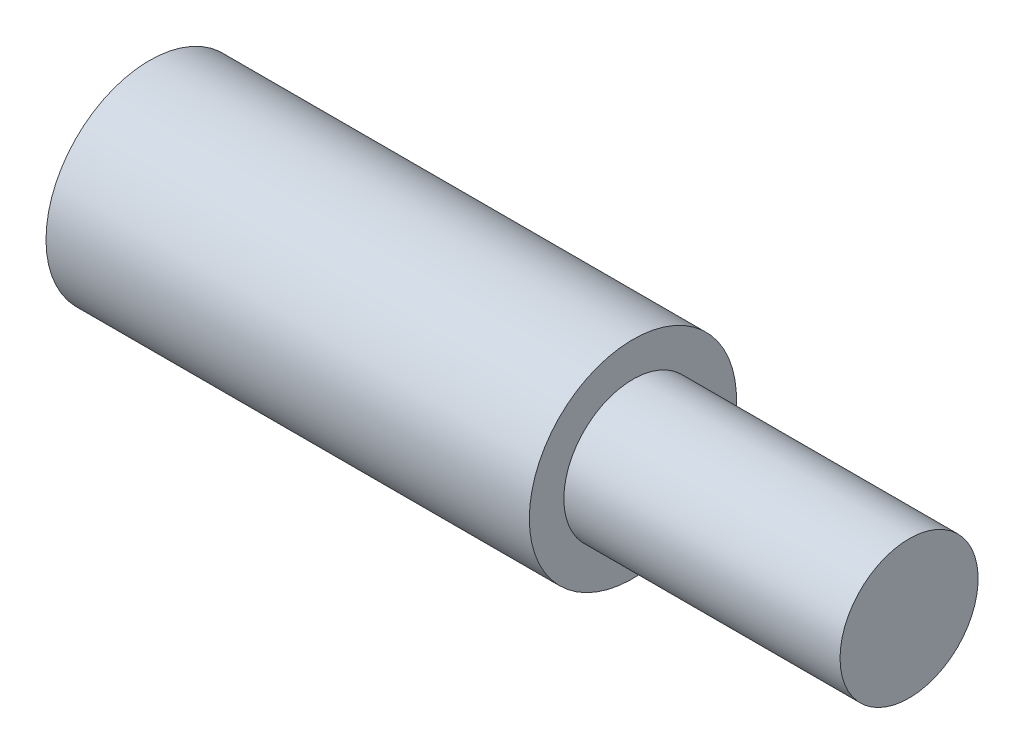
ISO-10303-21;
HEADER;
FILE_DESCRIPTION(('STEP AP214'),'2;1');
FILE_NAME('part.step','',(''),(''),'','','');
FILE_SCHEMA(('AUTOMOTIVE_DESIGN { 1 0 10303 214 1 1 1 1 }'));
ENDSEC;
DATA;
#1=APPLICATION_CONTEXT('core data for automotive mechanical design processes');
#2=APPLICATION_PROTOCOL_DEFINITION('international standard','automotive_design',2000,#1);
#3=PRODUCT_CONTEXT('',#1,'mechanical');
#4=PRODUCT('Part','Part','',(#3));
#5=PRODUCT_RELATED_PRODUCT_CATEGORY('part','',(#4));
#6=PRODUCT_DEFINITION_FORMATION('','',#4);
#7=PRODUCT_DEFINITION_CONTEXT('part definition',#1,'design');
#8=PRODUCT_DEFINITION('design','',#6,#7);
#9=PRODUCT_DEFINITION_SHAPE('','',#8);
#10=(LENGTH_UNIT() NAMED_UNIT(*) SI_UNIT(.MILLI.,.METRE.));
#11=(NAMED_UNIT(*) PLANE_ANGLE_UNIT() SI_UNIT($,.RADIAN.));
#12=(NAMED_UNIT(*) SI_UNIT($,.STERADIAN.) SOLID_ANGLE_UNIT());
#13=UNCERTAINTY_MEASURE_WITH_UNIT(LENGTH_MEASURE(1.E-05),#10,'distance_accuracy_value','');
#14=(GEOMETRIC_REPRESENTATION_CONTEXT(3) GLOBAL_UNCERTAINTY_ASSIGNED_CONTEXT((#13)) GLOBAL_UNIT_ASSIGNED_CONTEXT((#10,
#11,#12)) REPRESENTATION_CONTEXT('',''));
#15=CARTESIAN_POINT('',(0.,0.,0.));
#16=DIRECTION('',(0.,0.,1.));
#17=DIRECTION('',(1.,0.,0.));
#18=AXIS2_PLACEMENT_3D('',#15,#16,#17);
#19=CARTESIAN_POINT('',(0.,0.,0.));
#20=DIRECTION('',(1.,0.,0.));
#21=DIRECTION('',(0.,0.,-1.));
#22=AXIS2_PLACEMENT_3D('',#19,#20,#21);
#23=PLANE('',#22);
#24=CARTESIAN_POINT('',(0.,0.,0.));
#25=DIRECTION('',(-1.,0.,0.));
#26=DIRECTION('',(0.,0.,1.));
#27=AXIS2_PLACEMENT_3D('',#24,#25,#26);
#28=CIRCLE('',#27,1.5);
#29=CARTESIAN_POINT('',(0.,0.,1.5));
#30=VERTEX_POINT('',#29);
#31=EDGE_CURVE('E10',#30,#30,#28,.T.);
#32=ORIENTED_EDGE('',*,*,#31,.T.);
#33=EDGE_LOOP('',(#32));
#34=FACE_BOUND('',#33,.T.);
#35=ADVANCED_FACE('F32',(#34),#23,.F.);
#36=CARTESIAN_POINT('',(0.,0.,0.));
#37=DIRECTION('',(-1.,0.,0.));
#38=DIRECTION('',(0.,0.,1.));
#39=AXIS2_PLACEMENT_3D('',#36,#37,#38);
#40=CYLINDRICAL_SURFACE('',#39,1.5);
#41=ORIENTED_EDGE('',*,*,#31,.F.);
#42=EDGE_LOOP('',(#41));
#43=FACE_BOUND('',#42,.T.);
#44=CARTESIAN_POINT('',(7.,0.,0.));
#45=DIRECTION('',(-1.,0.,0.));
#46=DIRECTION('',(0.,0.,1.));
#47=AXIS2_PLACEMENT_3D('',#44,#45,#46);
#48=CIRCLE('',#47,1.5);
#49=CARTESIAN_POINT('',(7.,0.,1.5));
#50=VERTEX_POINT('',#49);
#51=EDGE_CURVE('E38',#50,#50,#48,.T.);
#52=ORIENTED_EDGE('',*,*,#51,.T.);
#53=EDGE_LOOP('',(#52));
#54=FACE_BOUND('',#53,.T.);
#55=ADVANCED_FACE('F64',(#43,#54),#40,.T.);
#56=CARTESIAN_POINT('',(7.,1.5,0.));
#57=DIRECTION('',(-1.,0.,0.));
#58=DIRECTION('',(0.,0.,1.));
#59=AXIS2_PLACEMENT_3D('',#56,#57,#58);
#60=PLANE('',#59);
#61=ORIENTED_EDGE('',*,*,#51,.F.);
#62=EDGE_LOOP('',(#61));
#63=FACE_BOUND('',#62,.T.);
#64=CARTESIAN_POINT('',(7.,0.,0.));
#65=DIRECTION('',(-1.,0.,0.));
#66=DIRECTION('',(0.,0.,1.));
#67=AXIS2_PLACEMENT_3D('',#64,#65,#66);
#68=CIRCLE('',#67,1.);
#69=CARTESIAN_POINT('',(7.,0.,1.));
#70=VERTEX_POINT('',#69);
#71=EDGE_CURVE('E42',#70,#70,#68,.T.);
#72=ORIENTED_EDGE('',*,*,#71,.T.);
#73=EDGE_LOOP('',(#72));
#74=FACE_BOUND('',#73,.T.);
#75=ADVANCED_FACE('F60',(#63,#74),#60,.F.);
#76=CARTESIAN_POINT('',(0.,0.,0.));
#77=DIRECTION('',(-1.,0.,0.));
#78=DIRECTION('',(0.,0.,1.));
#79=AXIS2_PLACEMENT_3D('',#76,#77,#78);
#80=CYLINDRICAL_SURFACE('',#79,1.);
#81=ORIENTED_EDGE('',*,*,#71,.F.);
#82=EDGE_LOOP('',(#81));
#83=FACE_BOUND('',#82,.T.);
#84=CARTESIAN_POINT('',(11.,0.,0.));
#85=DIRECTION('',(-1.,0.,0.));
#86=DIRECTION('',(0.,0.,1.));
#87=AXIS2_PLACEMENT_3D('',#84,#85,#86);
#88=CIRCLE('',#87,1.);
#89=CARTESIAN_POINT('',(11.,0.,1.));
#90=VERTEX_POINT('',#89);
#91=EDGE_CURVE('E46',#90,#90,#88,.T.);
#92=ORIENTED_EDGE('',*,*,#91,.T.);
#93=EDGE_LOOP('',(#92));
#94=FACE_BOUND('',#93,.T.);
#95=ADVANCED_FACE('F52',(#83,#94),#80,.T.);
#96=CARTESIAN_POINT('',(11.,1.,0.));
#97=DIRECTION('',(-1.,0.,0.));
#98=DIRECTION('',(0.,0.,1.));
#99=AXIS2_PLACEMENT_3D('',#96,#97,#98);
#100=PLANE('',#99);
#101=ORIENTED_EDGE('',*,*,#91,.F.);
#102=EDGE_LOOP('',(#101));
#103=FACE_BOUND('',#102,.T.);
#104=ADVANCED_FACE('F54',(#103),#100,.F.);
#105=CLOSED_SHELL('',(#35,#55,#75,#95,#104));
#106=MANIFOLD_SOLID_BREP('B2',#105);
#107=ADVANCED_BREP_SHAPE_REPRESENTATION('',(#18,#106),#14);
#108=SHAPE_DEFINITION_REPRESENTATION(#9,#107);
ENDSEC;
END-ISO-10303-21;
